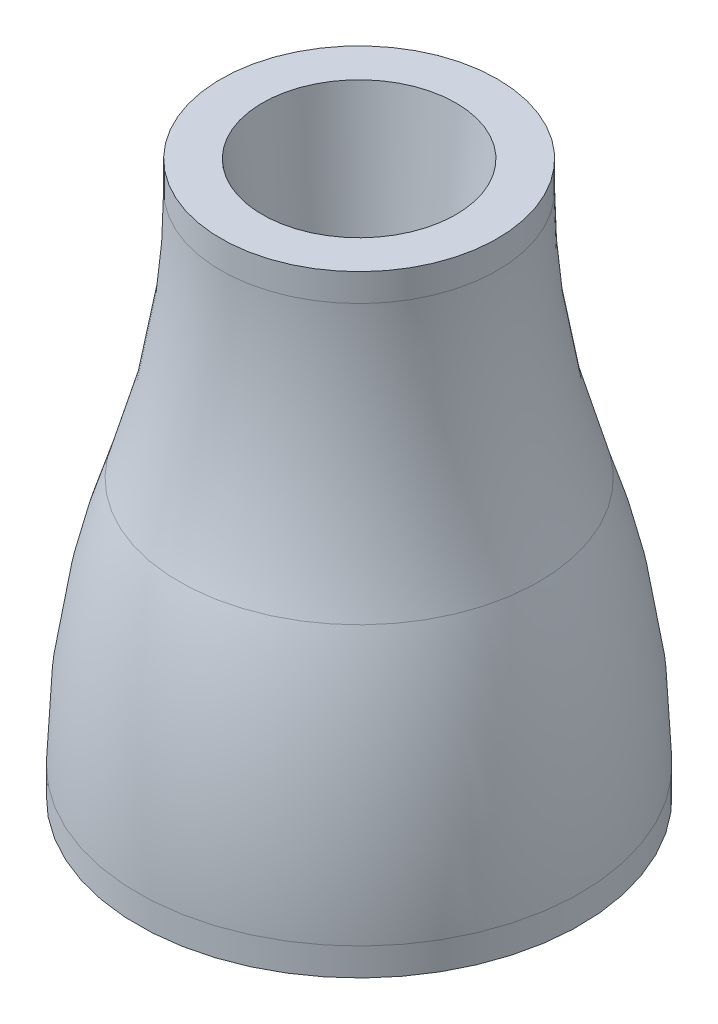
ISO-10303-21;
HEADER;
FILE_DESCRIPTION(('STEP AP214'),'2;1');
FILE_NAME('part.step','',(''),(''),'','','');
FILE_SCHEMA(('AUTOMOTIVE_DESIGN { 1 0 10303 214 1 1 1 1 }'));
ENDSEC;
DATA;
#1=APPLICATION_CONTEXT('core data for automotive mechanical design processes');
#2=APPLICATION_PROTOCOL_DEFINITION('international standard','automotive_design',2000,#1);
#3=PRODUCT_CONTEXT('',#1,'mechanical');
#4=PRODUCT('Part','Part','',(#3));
#5=PRODUCT_RELATED_PRODUCT_CATEGORY('part','',(#4));
#6=PRODUCT_DEFINITION_FORMATION('','',#4);
#7=PRODUCT_DEFINITION_CONTEXT('part definition',#1,'design');
#8=PRODUCT_DEFINITION('design','',#6,#7);
#9=PRODUCT_DEFINITION_SHAPE('','',#8);
#10=(LENGTH_UNIT() NAMED_UNIT(*) SI_UNIT(.MILLI.,.METRE.));
#11=(NAMED_UNIT(*) PLANE_ANGLE_UNIT() SI_UNIT($,.RADIAN.));
#12=(NAMED_UNIT(*) SI_UNIT($,.STERADIAN.) SOLID_ANGLE_UNIT());
#13=UNCERTAINTY_MEASURE_WITH_UNIT(LENGTH_MEASURE(1.E-05),#10,'distance_accuracy_value','');
#14=(GEOMETRIC_REPRESENTATION_CONTEXT(3) GLOBAL_UNCERTAINTY_ASSIGNED_CONTEXT((#13)) GLOBAL_UNIT_ASSIGNED_CONTEXT((#10,
#11,#12)) REPRESENTATION_CONTEXT('',''));
#15=CARTESIAN_POINT('',(0.,0.,0.));
#16=DIRECTION('',(0.,0.,1.));
#17=DIRECTION('',(1.,0.,0.));
#18=AXIS2_PLACEMENT_3D('',#15,#16,#17);
#19=CARTESIAN_POINT('',(0.9,-2.,0.));
#20=DIRECTION('',(0.,-1.,0.));
#21=DIRECTION('',(0.,0.,-1.));
#22=AXIS2_PLACEMENT_3D('',#19,#20,#21);
#23=PLANE('',#22);
#24=CARTESIAN_POINT('',(0.,-2.,0.));
#25=DIRECTION('',(0.,-1.,0.));
#26=DIRECTION('',(0.,0.,-1.));
#27=AXIS2_PLACEMENT_3D('',#24,#25,#26);
#28=CIRCLE('',#27,2.4);
#29=CARTESIAN_POINT('',(0.,-2.,-2.4));
#30=VERTEX_POINT('',#29);
#31=EDGE_CURVE('E10',#30,#30,#28,.T.);
#32=ORIENTED_EDGE('',*,*,#31,.T.);
#33=EDGE_LOOP('',(#32));
#34=FACE_BOUND('',#33,.T.);
#35=CARTESIAN_POINT('',(0.,-2.,0.));
#36=DIRECTION('',(0.,-1.,0.));
#37=DIRECTION('',(0.,0.,-1.));
#38=AXIS2_PLACEMENT_3D('',#35,#36,#37);
#39=CIRCLE('',#38,0.9);
#40=CARTESIAN_POINT('',(0.,-2.,-0.9));
#41=VERTEX_POINT('',#40);
#42=EDGE_CURVE('E62',#41,#41,#39,.T.);
#43=ORIENTED_EDGE('',*,*,#42,.F.);
#44=EDGE_LOOP('',(#43));
#45=FACE_BOUND('',#44,.T.);
#46=ADVANCED_FACE('F31',(#34,#45),#23,.T.);
#47=CARTESIAN_POINT('',(0.,0.,0.));
#48=DIRECTION('',(0.,-1.,0.));
#49=DIRECTION('',(0.,0.,-1.));
#50=AXIS2_PLACEMENT_3D('',#47,#48,#49);
#51=CYLINDRICAL_SURFACE('',#50,2.4);
#52=CARTESIAN_POINT('',(0.,0.,0.));
#53=DIRECTION('',(0.,-1.,0.));
#54=DIRECTION('',(0.,0.,-1.));
#55=AXIS2_PLACEMENT_3D('',#52,#53,#54);
#56=CIRCLE('',#55,2.4);
#57=CARTESIAN_POINT('',(0.,0.,-2.4));
#58=VERTEX_POINT('',#57);
#59=EDGE_CURVE('E37',#58,#58,#56,.T.);
#60=ORIENTED_EDGE('',*,*,#59,.T.);
#61=EDGE_LOOP('',(#60));
#62=FACE_BOUND('',#61,.T.);
#63=ORIENTED_EDGE('',*,*,#31,.F.);
#64=EDGE_LOOP('',(#63));
#65=FACE_BOUND('',#64,.T.);
#66=ADVANCED_FACE('F70',(#62,#65),#51,.T.);
#67=CARTESIAN_POINT('',(2.4,0.,0.));
#68=DIRECTION('',(0.,-1.,0.));
#69=DIRECTION('',(0.,0.,-1.));
#70=AXIS2_PLACEMENT_3D('',#67,#68,#69);
#71=PLANE('',#70);
#72=CARTESIAN_POINT('',(0.,0.,0.));
#73=DIRECTION('',(0.,-1.,0.));
#74=DIRECTION('',(0.,0.,-1.));
#75=AXIS2_PLACEMENT_3D('',#72,#73,#74);
#76=CIRCLE('',#75,8.);
#77=CARTESIAN_POINT('',(0.,0.,-8.));
#78=VERTEX_POINT('',#77);
#79=EDGE_CURVE('E41',#78,#78,#76,.T.);
#80=ORIENTED_EDGE('',*,*,#79,.T.);
#81=EDGE_LOOP('',(#80));
#82=FACE_BOUND('',#81,.T.);
#83=ORIENTED_EDGE('',*,*,#59,.F.);
#84=EDGE_LOOP('',(#83));
#85=FACE_BOUND('',#84,.T.);
#86=ADVANCED_FACE('F74',(#82,#85),#71,.T.);
#87=CARTESIAN_POINT('',(0.,0.,0.));
#88=DIRECTION('',(0.,-1.,0.));
#89=DIRECTION('',(0.,0.,-1.));
#90=AXIS2_PLACEMENT_3D('',#87,#88,#89);
#91=CYLINDRICAL_SURFACE('',#90,8.);
#92=CARTESIAN_POINT('',(0.,1.,0.));
#93=DIRECTION('',(0.,-1.,0.));
#94=DIRECTION('',(0.,0.,-1.));
#95=AXIS2_PLACEMENT_3D('',#92,#93,#94);
#96=CIRCLE('',#95,8.);
#97=CARTESIAN_POINT('',(0.,1.,-8.));
#98=VERTEX_POINT('',#97);
#99=EDGE_CURVE('E45',#98,#98,#96,.T.);
#100=ORIENTED_EDGE('',*,*,#99,.T.);
#101=EDGE_LOOP('',(#100));
#102=FACE_BOUND('',#101,.T.);
#103=ORIENTED_EDGE('',*,*,#79,.F.);
#104=EDGE_LOOP('',(#103));
#105=FACE_BOUND('',#104,.T.);
#106=ADVANCED_FACE('F78',(#102,#105),#91,.T.);
#107=CARTESIAN_POINT('',(0.,1.,0.));
#108=DIRECTION('',(0.,-1.,0.));
#109=DIRECTION('',(0.,0.,-1.));
#110=AXIS2_PLACEMENT_3D('',#107,#108,#109);
#111=DEGENERATE_TOROIDAL_SURFACE('',#110,19.7499999999985,27.7499999999985,.F.);
#112=CARTESIAN_POINT('',(0.,9.99999999999999,0.));
#113=DIRECTION('',(0.,-1.,0.));
#114=DIRECTION('',(0.,0.,-1.));
#115=AXIS2_PLACEMENT_3D('',#112,#113,#114);
#116=CIRCLE('',#115,6.49999999999996);
#117=CARTESIAN_POINT('',(0.,9.99999999999999,-6.49999999999996));
#118=VERTEX_POINT('',#117);
#119=EDGE_CURVE('E50',#118,#118,#116,.T.);
#120=ORIENTED_EDGE('',*,*,#119,.T.);
#121=EDGE_LOOP('',(#120));
#122=FACE_BOUND('',#121,.T.);
#123=ORIENTED_EDGE('',*,*,#99,.F.);
#124=EDGE_LOOP('',(#123));
#125=FACE_BOUND('',#124,.T.);
#126=ADVANCED_FACE('F85',(#122,#125),#111,.F.);
#127=CARTESIAN_POINT('',(0.,19.,0.));
#128=DIRECTION('',(0.,-1.,0.));
#129=DIRECTION('',(0.,0.,-1.));
#130=AXIS2_PLACEMENT_3D('',#127,#128,#129);
#131=TOROIDAL_SURFACE('',#130,32.7499999999985,27.7499999999985);
#132=CARTESIAN_POINT('',(0.,19.,0.));
#133=DIRECTION('',(0.,-1.,0.));
#134=DIRECTION('',(0.,0.,-1.));
#135=AXIS2_PLACEMENT_3D('',#132,#133,#134);
#136=CIRCLE('',#135,4.99999999999996);
#137=CARTESIAN_POINT('',(0.,19.,-4.99999999999996));
#138=VERTEX_POINT('',#137);
#139=EDGE_CURVE('E53',#138,#138,#136,.T.);
#140=ORIENTED_EDGE('',*,*,#139,.T.);
#141=EDGE_LOOP('',(#140));
#142=FACE_BOUND('',#141,.T.);
#143=ORIENTED_EDGE('',*,*,#119,.F.);
#144=EDGE_LOOP('',(#143));
#145=FACE_BOUND('',#144,.T.);
#146=ADVANCED_FACE('F89',(#142,#145),#131,.F.);
#147=CARTESIAN_POINT('',(0.,0.,0.));
#148=DIRECTION('',(0.,-1.,0.));
#149=DIRECTION('',(0.,0.,-1.));
#150=AXIS2_PLACEMENT_3D('',#147,#148,#149);
#151=CYLINDRICAL_SURFACE('',#150,4.99999999999998);
#152=CARTESIAN_POINT('',(0.,20.,0.));
#153=DIRECTION('',(0.,-1.,0.));
#154=DIRECTION('',(0.,0.,-1.));
#155=AXIS2_PLACEMENT_3D('',#152,#153,#154);
#156=CIRCLE('',#155,5.);
#157=CARTESIAN_POINT('',(0.,20.,-5.));
#158=VERTEX_POINT('',#157);
#159=EDGE_CURVE('E56',#158,#158,#156,.T.);
#160=ORIENTED_EDGE('',*,*,#159,.T.);
#161=EDGE_LOOP('',(#160));
#162=FACE_BOUND('',#161,.T.);
#163=ORIENTED_EDGE('',*,*,#139,.F.);
#164=EDGE_LOOP('',(#163));
#165=FACE_BOUND('',#164,.T.);
#166=ADVANCED_FACE('F93',(#162,#165),#151,.T.);
#167=CARTESIAN_POINT('',(5.,20.,0.));
#168=DIRECTION('',(0.,1.,0.));
#169=DIRECTION('',(0.,0.,1.));
#170=AXIS2_PLACEMENT_3D('',#167,#168,#169);
#171=PLANE('',#170);
#172=CARTESIAN_POINT('',(0.,20.,0.));
#173=DIRECTION('',(0.,-1.,0.));
#174=DIRECTION('',(0.,0.,-1.));
#175=AXIS2_PLACEMENT_3D('',#172,#173,#174);
#176=CIRCLE('',#175,3.5);
#177=CARTESIAN_POINT('',(0.,20.,-3.5));
#178=VERTEX_POINT('',#177);
#179=EDGE_CURVE('E59',#178,#178,#176,.T.);
#180=ORIENTED_EDGE('',*,*,#179,.T.);
#181=EDGE_LOOP('',(#180));
#182=FACE_BOUND('',#181,.T.);
#183=ORIENTED_EDGE('',*,*,#159,.F.);
#184=EDGE_LOOP('',(#183));
#185=FACE_BOUND('',#184,.T.);
#186=ADVANCED_FACE('F97',(#182,#185),#171,.T.);
#187=CARTESIAN_POINT('',(0.,20.,0.));
#188=DIRECTION('',(0.,1.,0.));
#189=DIRECTION('',(0.,0.,1.));
#190=AXIS2_PLACEMENT_3D('',#187,#188,#189);
#191=CONICAL_SURFACE('',#190,3.5,0.117636170678296);
#192=ORIENTED_EDGE('',*,*,#42,.T.);
#193=EDGE_LOOP('',(#192));
#194=FACE_BOUND('',#193,.T.);
#195=ORIENTED_EDGE('',*,*,#179,.F.);
#196=EDGE_LOOP('',(#195));
#197=FACE_BOUND('',#196,.T.);
#198=ADVANCED_FACE('F66',(#194,#197),#191,.F.);
#199=CLOSED_SHELL('',(#46,#66,#86,#106,#126,#146,#166,#186,#198));
#200=MANIFOLD_SOLID_BREP('B2',#199);
#201=ADVANCED_BREP_SHAPE_REPRESENTATION('',(#18,#200),#14);
#202=SHAPE_DEFINITION_REPRESENTATION(#9,#201);
ENDSEC;
END-ISO-10303-21;
